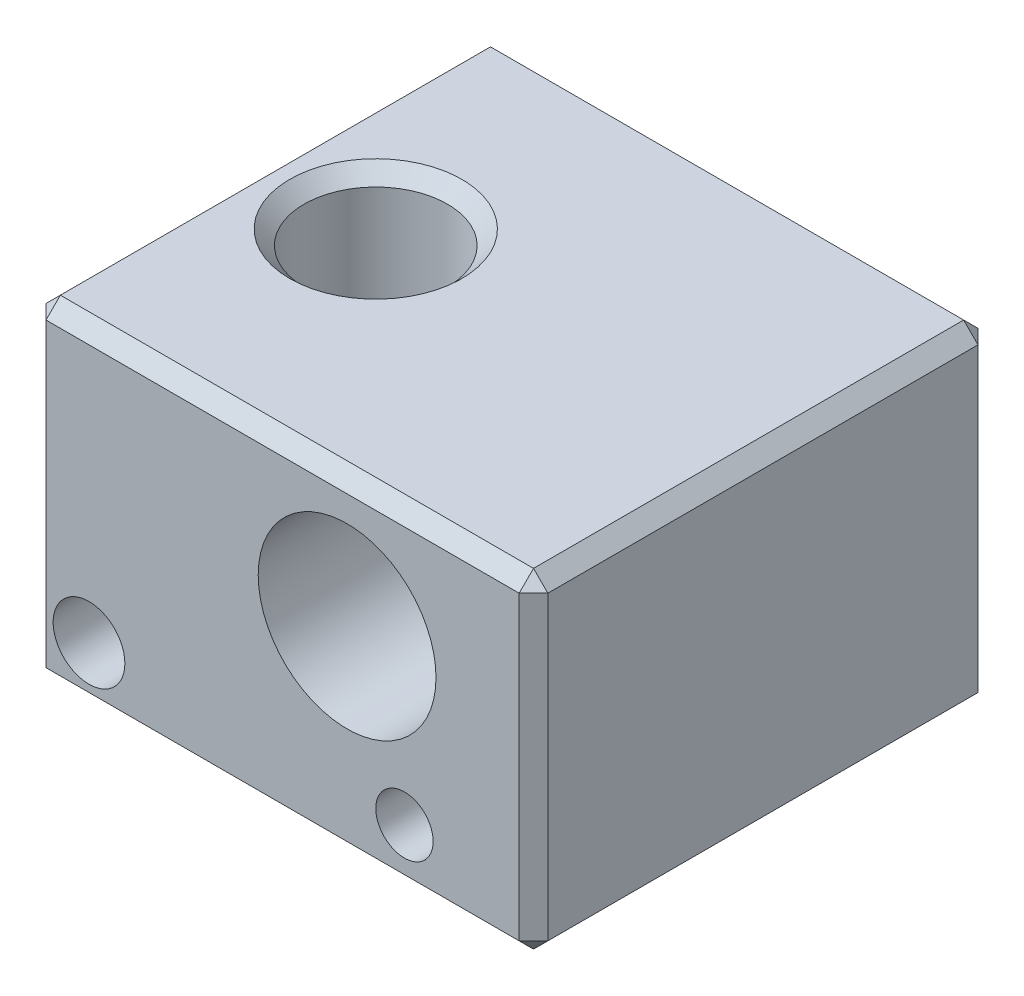
ISO-10303-21;
HEADER;
FILE_DESCRIPTION(('STEP AP214'),'2;1');
FILE_NAME('part.step','',(''),(''),'','','');
FILE_SCHEMA(('AUTOMOTIVE_DESIGN { 1 0 10303 214 1 1 1 1 }'));
ENDSEC;
DATA;
#1=APPLICATION_CONTEXT('core data for automotive mechanical design processes');
#2=APPLICATION_PROTOCOL_DEFINITION('international standard','automotive_design',2000,#1);
#3=PRODUCT_CONTEXT('',#1,'mechanical');
#4=PRODUCT('Part','Part','',(#3));
#5=PRODUCT_RELATED_PRODUCT_CATEGORY('part','',(#4));
#6=PRODUCT_DEFINITION_FORMATION('','',#4);
#7=PRODUCT_DEFINITION_CONTEXT('part definition',#1,'design');
#8=PRODUCT_DEFINITION('design','',#6,#7);
#9=PRODUCT_DEFINITION_SHAPE('','',#8);
#10=(LENGTH_UNIT() NAMED_UNIT(*) SI_UNIT(.MILLI.,.METRE.));
#11=(NAMED_UNIT(*) PLANE_ANGLE_UNIT() SI_UNIT($,.RADIAN.));
#12=(NAMED_UNIT(*) SI_UNIT($,.STERADIAN.) SOLID_ANGLE_UNIT());
#13=UNCERTAINTY_MEASURE_WITH_UNIT(LENGTH_MEASURE(1.E-05),#10,'distance_accuracy_value','');
#14=(GEOMETRIC_REPRESENTATION_CONTEXT(3) GLOBAL_UNCERTAINTY_ASSIGNED_CONTEXT((#13)) GLOBAL_UNIT_ASSIGNED_CONTEXT((#10,
#11,#12)) REPRESENTATION_CONTEXT('',''));
#15=CARTESIAN_POINT('',(0.,0.,0.));
#16=DIRECTION('',(0.,0.,1.));
#17=DIRECTION('',(1.,0.,0.));
#18=AXIS2_PLACEMENT_3D('',#15,#16,#17);
#19=CARTESIAN_POINT('',(-8.75,11.5,8.));
#20=DIRECTION('',(0.,0.,-1.));
#21=DIRECTION('',(-1.,0.,0.));
#22=AXIS2_PLACEMENT_3D('',#19,#20,#21);
#23=PLANE('',#22);
#24=DIRECTION('',(0.,-1.,0.));
#25=VECTOR('',#24,1.);
#26=CARTESIAN_POINT('',(-8.25,0.,8.));
#27=LINE('',#26,#25);
#28=CARTESIAN_POINT('',(-8.25,11.,8.));
#29=VERTEX_POINT('',#28);
#30=CARTESIAN_POINT('',(-8.25,0.500000000000004,8.));
#31=VERTEX_POINT('',#30);
#32=EDGE_CURVE('E354',#29,#31,#27,.T.);
#33=ORIENTED_EDGE('',*,*,#32,.T.);
#34=DIRECTION('',(1.,0.,0.));
#35=VECTOR('',#34,1.);
#36=CARTESIAN_POINT('',(-8.75,0.500000000000004,8.));
#37=LINE('',#36,#35);
#38=CARTESIAN_POINT('',(8.25,0.500000000000004,8.));
#39=VERTEX_POINT('',#38);
#40=EDGE_CURVE('E362',#31,#39,#37,.T.);
#41=ORIENTED_EDGE('',*,*,#40,.T.);
#42=DIRECTION('',(0.,1.,0.));
#43=VECTOR('',#42,1.);
#44=CARTESIAN_POINT('',(8.25,11.5,8.));
#45=LINE('',#44,#43);
#46=CARTESIAN_POINT('',(8.25,11.,8.));
#47=VERTEX_POINT('',#46);
#48=EDGE_CURVE('E344',#39,#47,#45,.T.);
#49=ORIENTED_EDGE('',*,*,#48,.T.);
#50=DIRECTION('',(-1.,0.,0.));
#51=VECTOR('',#50,1.);
#52=CARTESIAN_POINT('',(-8.75,11.,8.));
#53=LINE('',#52,#51);
#54=EDGE_CURVE('E350',#47,#29,#53,.T.);
#55=ORIENTED_EDGE('',*,*,#54,.T.);
#56=EDGE_LOOP('',(#33,#41,#49,#55));
#57=FACE_BOUND('',#56,.T.);
#58=CARTESIAN_POINT('',(-6.75,2.,8.));
#59=DIRECTION('',(0.,0.,1.));
#60=DIRECTION('',(1.,0.,0.));
#61=AXIS2_PLACEMENT_3D('',#58,#59,#60);
#62=CIRCLE('',#61,1.25);
#63=CARTESIAN_POINT('',(-5.5,2.,8.));
#64=VERTEX_POINT('',#63);
#65=EDGE_CURVE('E222',#64,#64,#62,.T.);
#66=ORIENTED_EDGE('',*,*,#65,.F.);
#67=EDGE_LOOP('',(#66));
#68=FACE_BOUND('',#67,.T.);
#69=CARTESIAN_POINT('',(4.25,2.,8.));
#70=DIRECTION('',(0.,0.,1.));
#71=DIRECTION('',(1.,0.,0.));
#72=AXIS2_PLACEMENT_3D('',#69,#70,#71);
#73=CIRCLE('',#72,1.);
#74=CARTESIAN_POINT('',(5.25,2.,8.));
#75=VERTEX_POINT('',#74);
#76=EDGE_CURVE('E419',#75,#75,#73,.T.);
#77=ORIENTED_EDGE('',*,*,#76,.F.);
#78=EDGE_LOOP('',(#77));
#79=FACE_BOUND('',#78,.T.);
#80=CARTESIAN_POINT('',(2.25,7.,8.));
#81=DIRECTION('',(0.,0.,1.));
#82=DIRECTION('',(1.,0.,0.));
#83=AXIS2_PLACEMENT_3D('',#80,#81,#82);
#84=CIRCLE('',#83,3.1);
#85=CARTESIAN_POINT('',(5.35,7.,8.));
#86=VERTEX_POINT('',#85);
#87=EDGE_CURVE('E413',#86,#86,#84,.T.);
#88=ORIENTED_EDGE('',*,*,#87,.F.);
#89=EDGE_LOOP('',(#88));
#90=FACE_BOUND('',#89,.T.);
#91=ADVANCED_FACE('F33',(#57,#68,#79,#90),#23,.F.);
#92=CARTESIAN_POINT('',(8.75,11.5,8.));
#93=DIRECTION('',(-1.,0.,0.));
#94=DIRECTION('',(0.,0.,1.));
#95=AXIS2_PLACEMENT_3D('',#92,#93,#94);
#96=PLANE('',#95);
#97=DIRECTION('',(0.,0.,1.));
#98=VECTOR('',#97,1.);
#99=CARTESIAN_POINT('',(8.75,11.,8.));
#100=LINE('',#99,#98);
#101=CARTESIAN_POINT('',(8.75,11.,-7.5));
#102=VERTEX_POINT('',#101);
#103=CARTESIAN_POINT('',(8.75,11.,7.5));
#104=VERTEX_POINT('',#103);
#105=EDGE_CURVE('E364',#102,#104,#100,.T.);
#106=ORIENTED_EDGE('',*,*,#105,.T.);
#107=DIRECTION('',(0.,-1.,0.));
#108=VECTOR('',#107,1.);
#109=CARTESIAN_POINT('',(8.75,11.5,7.5));
#110=LINE('',#109,#108);
#111=CARTESIAN_POINT('',(8.75,0.5,7.5));
#112=VERTEX_POINT('',#111);
#113=EDGE_CURVE('E346',#104,#112,#110,.T.);
#114=ORIENTED_EDGE('',*,*,#113,.T.);
#115=DIRECTION('',(0.,0.,-1.));
#116=VECTOR('',#115,1.);
#117=CARTESIAN_POINT('',(8.75,0.5,8.));
#118=LINE('',#117,#116);
#119=CARTESIAN_POINT('',(8.75,0.5,-7.5));
#120=VERTEX_POINT('',#119);
#121=EDGE_CURVE('E368',#112,#120,#118,.T.);
#122=ORIENTED_EDGE('',*,*,#121,.T.);
#123=DIRECTION('',(0.,1.,0.));
#124=VECTOR('',#123,1.);
#125=CARTESIAN_POINT('',(8.75,11.5,-7.5));
#126=LINE('',#125,#124);
#127=EDGE_CURVE('E366',#120,#102,#126,.T.);
#128=ORIENTED_EDGE('',*,*,#127,.T.);
#129=EDGE_LOOP('',(#106,#114,#122,#128));
#130=FACE_BOUND('',#129,.T.);
#131=ADVANCED_FACE('F254',(#130),#96,.F.);
#132=CARTESIAN_POINT('',(-8.75,11.5,-8.));
#133=DIRECTION('',(0.,0.,-1.));
#134=DIRECTION('',(-1.,0.,0.));
#135=AXIS2_PLACEMENT_3D('',#132,#133,#134);
#136=PLANE('',#135);
#137=DIRECTION('',(-1.,0.,0.));
#138=VECTOR('',#137,1.);
#139=CARTESIAN_POINT('',(-8.75,0.500000000000004,-8.));
#140=LINE('',#139,#138);
#141=CARTESIAN_POINT('',(8.25,0.500000000000004,-8.));
#142=VERTEX_POINT('',#141);
#143=CARTESIAN_POINT('',(-8.25,0.500000000000004,-8.));
#144=VERTEX_POINT('',#143);
#145=EDGE_CURVE('E357',#142,#144,#140,.T.);
#146=ORIENTED_EDGE('',*,*,#145,.T.);
#147=DIRECTION('',(0.,1.,0.));
#148=VECTOR('',#147,1.);
#149=CARTESIAN_POINT('',(-8.25,11.5,-8.));
#150=LINE('',#149,#148);
#151=CARTESIAN_POINT('',(-8.25,11.,-8.));
#152=VERTEX_POINT('',#151);
#153=EDGE_CURVE('E352',#144,#152,#150,.T.);
#154=ORIENTED_EDGE('',*,*,#153,.T.);
#155=DIRECTION('',(1.,0.,0.));
#156=VECTOR('',#155,1.);
#157=CARTESIAN_POINT('',(-8.75,11.,-8.));
#158=LINE('',#157,#156);
#159=CARTESIAN_POINT('',(8.25,11.,-8.));
#160=VERTEX_POINT('',#159);
#161=EDGE_CURVE('E383',#152,#160,#158,.T.);
#162=ORIENTED_EDGE('',*,*,#161,.T.);
#163=DIRECTION('',(0.,-1.,0.));
#164=VECTOR('',#163,1.);
#165=CARTESIAN_POINT('',(8.25,0.,-8.));
#166=LINE('',#165,#164);
#167=EDGE_CURVE('E385',#160,#142,#166,.T.);
#168=ORIENTED_EDGE('',*,*,#167,.T.);
#169=EDGE_LOOP('',(#146,#154,#162,#168));
#170=FACE_BOUND('',#169,.T.);
#171=CARTESIAN_POINT('',(4.25,2.,-8.));
#172=DIRECTION('',(0.,0.,1.));
#173=DIRECTION('',(1.,0.,0.));
#174=AXIS2_PLACEMENT_3D('',#171,#172,#173);
#175=CIRCLE('',#174,1.);
#176=CARTESIAN_POINT('',(5.25,2.,-8.));
#177=VERTEX_POINT('',#176);
#178=EDGE_CURVE('E416',#177,#177,#175,.T.);
#179=ORIENTED_EDGE('',*,*,#178,.T.);
#180=EDGE_LOOP('',(#179));
#181=FACE_BOUND('',#180,.T.);
#182=CARTESIAN_POINT('',(2.25,7.,-8.));
#183=DIRECTION('',(0.,0.,1.));
#184=DIRECTION('',(1.,0.,0.));
#185=AXIS2_PLACEMENT_3D('',#182,#183,#184);
#186=CIRCLE('',#185,3.1);
#187=CARTESIAN_POINT('',(5.35,7.,-8.));
#188=VERTEX_POINT('',#187);
#189=EDGE_CURVE('E143',#188,#188,#186,.T.);
#190=ORIENTED_EDGE('',*,*,#189,.T.);
#191=EDGE_LOOP('',(#190));
#192=FACE_BOUND('',#191,.T.);
#193=ADVANCED_FACE('F260',(#170,#181,#192),#136,.T.);
#194=CARTESIAN_POINT('',(-8.75,11.5,8.));
#195=DIRECTION('',(-1.,0.,0.));
#196=DIRECTION('',(0.,0.,1.));
#197=AXIS2_PLACEMENT_3D('',#194,#195,#196);
#198=PLANE('',#197);
#199=DIRECTION('',(0.,-1.,0.));
#200=VECTOR('',#199,1.);
#201=CARTESIAN_POINT('',(-8.75,11.5,-7.5));
#202=LINE('',#201,#200);
#203=CARTESIAN_POINT('',(-8.75,11.,-7.5));
#204=VERTEX_POINT('',#203);
#205=CARTESIAN_POINT('',(-8.75,0.500000000000004,-7.5));
#206=VERTEX_POINT('',#205);
#207=EDGE_CURVE('E378',#204,#206,#202,.T.);
#208=ORIENTED_EDGE('',*,*,#207,.T.);
#209=DIRECTION('',(0.,0.,1.));
#210=VECTOR('',#209,1.);
#211=CARTESIAN_POINT('',(-8.75,0.500000000000004,8.));
#212=LINE('',#211,#210);
#213=CARTESIAN_POINT('',(-8.75,0.500000000000004,7.5));
#214=VERTEX_POINT('',#213);
#215=EDGE_CURVE('E149',#206,#214,#212,.T.);
#216=ORIENTED_EDGE('',*,*,#215,.T.);
#217=DIRECTION('',(0.,1.,0.));
#218=VECTOR('',#217,1.);
#219=CARTESIAN_POINT('',(-8.75,11.5,7.5));
#220=LINE('',#219,#218);
#221=CARTESIAN_POINT('',(-8.75,11.,7.5));
#222=VERTEX_POINT('',#221);
#223=EDGE_CURVE('E392',#214,#222,#220,.T.);
#224=ORIENTED_EDGE('',*,*,#223,.T.);
#225=DIRECTION('',(0.,0.,-1.));
#226=VECTOR('',#225,1.);
#227=CARTESIAN_POINT('',(-8.75,11.,8.));
#228=LINE('',#227,#226);
#229=EDGE_CURVE('E394',#222,#204,#228,.T.);
#230=ORIENTED_EDGE('',*,*,#229,.T.);
#231=EDGE_LOOP('',(#208,#216,#224,#230));
#232=FACE_BOUND('',#231,.T.);
#233=ADVANCED_FACE('F454',(#232),#198,.T.);
#234=CARTESIAN_POINT('',(0.,11.5,0.));
#235=DIRECTION('',(0.,1.,0.));
#236=DIRECTION('',(0.,0.,1.));
#237=AXIS2_PLACEMENT_3D('',#234,#235,#236);
#238=PLANE('',#237);
#239=DIRECTION('',(-1.,0.,0.));
#240=VECTOR('',#239,1.);
#241=CARTESIAN_POINT('',(0.,11.5,-7.5));
#242=LINE('',#241,#240);
#243=CARTESIAN_POINT('',(8.25,11.5,-7.5));
#244=VERTEX_POINT('',#243);
#245=CARTESIAN_POINT('',(-8.25,11.5,-7.5));
#246=VERTEX_POINT('',#245);
#247=EDGE_CURVE('E42',#244,#246,#242,.T.);
#248=ORIENTED_EDGE('',*,*,#247,.T.);
#249=DIRECTION('',(0.,0.,1.));
#250=VECTOR('',#249,1.);
#251=CARTESIAN_POINT('',(-8.25,11.5,0.));
#252=LINE('',#251,#250);
#253=CARTESIAN_POINT('',(-8.25,11.5,7.5));
#254=VERTEX_POINT('',#253);
#255=EDGE_CURVE('E11',#246,#254,#252,.T.);
#256=ORIENTED_EDGE('',*,*,#255,.T.);
#257=DIRECTION('',(1.,0.,0.));
#258=VECTOR('',#257,1.);
#259=CARTESIAN_POINT('',(8.75,11.5,7.5));
#260=LINE('',#259,#258);
#261=CARTESIAN_POINT('',(8.25,11.5,7.5));
#262=VERTEX_POINT('',#261);
#263=EDGE_CURVE('E374',#254,#262,#260,.T.);
#264=ORIENTED_EDGE('',*,*,#263,.T.);
#265=DIRECTION('',(0.,0.,-1.));
#266=VECTOR('',#265,1.);
#267=CARTESIAN_POINT('',(8.25,11.5,-8.));
#268=LINE('',#267,#266);
#269=EDGE_CURVE('E53',#262,#244,#268,.T.);
#270=ORIENTED_EDGE('',*,*,#269,.T.);
#271=EDGE_LOOP('',(#248,#256,#264,#270));
#272=FACE_BOUND('',#271,.T.);
#273=CARTESIAN_POINT('',(-4.75,11.5,0.));
#274=DIRECTION('',(0.,1.,0.));
#275=DIRECTION('',(0.,0.,1.));
#276=AXIS2_PLACEMENT_3D('',#273,#274,#275);
#277=CIRCLE('',#276,2.99999999999999);
#278=CARTESIAN_POINT('',(-4.75,11.5,2.99999999999999));
#279=VERTEX_POINT('',#278);
#280=EDGE_CURVE('E371',#279,#279,#277,.F.);
#281=ORIENTED_EDGE('',*,*,#280,.T.);
#282=EDGE_LOOP('',(#281));
#283=FACE_BOUND('',#282,.T.);
#284=ADVANCED_FACE('F447',(#272,#283),#238,.T.);
#285=CARTESIAN_POINT('',(0.,0.,0.));
#286=DIRECTION('',(0.,1.,0.));
#287=DIRECTION('',(0.,0.,1.));
#288=AXIS2_PLACEMENT_3D('',#285,#286,#287);
#289=PLANE('',#288);
#290=CARTESIAN_POINT('',(-4.75,0.,0.));
#291=DIRECTION('',(0.,1.,0.));
#292=DIRECTION('',(0.,0.,1.));
#293=AXIS2_PLACEMENT_3D('',#290,#291,#292);
#294=CIRCLE('',#293,2.99999999999999);
#295=CARTESIAN_POINT('',(-4.75,0.,2.99999999999999));
#296=VERTEX_POINT('',#295);
#297=EDGE_CURVE('E404',#296,#296,#294,.T.);
#298=ORIENTED_EDGE('',*,*,#297,.T.);
#299=EDGE_LOOP('',(#298));
#300=FACE_BOUND('',#299,.T.);
#301=CARTESIAN_POINT('',(1.25,0.,0.));
#302=DIRECTION('',(0.,1.,0.));
#303=DIRECTION('',(0.,0.,1.));
#304=AXIS2_PLACEMENT_3D('',#301,#302,#303);
#305=CIRCLE('',#304,1.74999999999999);
#306=CARTESIAN_POINT('',(1.25,0.,1.74999999999999));
#307=VERTEX_POINT('',#306);
#308=EDGE_CURVE('E407',#307,#307,#305,.T.);
#309=ORIENTED_EDGE('',*,*,#308,.T.);
#310=EDGE_LOOP('',(#309));
#311=FACE_BOUND('',#310,.T.);
#312=DIRECTION('',(1.,0.,0.));
#313=VECTOR('',#312,1.);
#314=CARTESIAN_POINT('',(8.75,0.,-7.5));
#315=LINE('',#314,#313);
#316=CARTESIAN_POINT('',(-8.25,0.,-7.5));
#317=VERTEX_POINT('',#316);
#318=CARTESIAN_POINT('',(8.25,0.,-7.5));
#319=VERTEX_POINT('',#318);
#320=EDGE_CURVE('E125',#317,#319,#315,.T.);
#321=ORIENTED_EDGE('',*,*,#320,.T.);
#322=DIRECTION('',(0.,0.,1.));
#323=VECTOR('',#322,1.);
#324=CARTESIAN_POINT('',(8.25,0.,0.));
#325=LINE('',#324,#323);
#326=CARTESIAN_POINT('',(8.25,0.,7.5));
#327=VERTEX_POINT('',#326);
#328=EDGE_CURVE('E410',#319,#327,#325,.T.);
#329=ORIENTED_EDGE('',*,*,#328,.T.);
#330=DIRECTION('',(-1.,0.,0.));
#331=VECTOR('',#330,1.);
#332=CARTESIAN_POINT('',(0.,0.,7.5));
#333=LINE('',#332,#331);
#334=CARTESIAN_POINT('',(-8.25,0.,7.5));
#335=VERTEX_POINT('',#334);
#336=EDGE_CURVE('E127',#327,#335,#333,.T.);
#337=ORIENTED_EDGE('',*,*,#336,.T.);
#338=DIRECTION('',(0.,0.,-1.));
#339=VECTOR('',#338,1.);
#340=CARTESIAN_POINT('',(-8.25,0.,-8.));
#341=LINE('',#340,#339);
#342=EDGE_CURVE('E121',#335,#317,#341,.T.);
#343=ORIENTED_EDGE('',*,*,#342,.T.);
#344=EDGE_LOOP('',(#321,#329,#337,#343));
#345=FACE_BOUND('',#344,.T.);
#346=ADVANCED_FACE('F123',(#300,#311,#345),#289,.F.);
#347=CARTESIAN_POINT('',(2.25,7.,-8.));
#348=DIRECTION('',(0.,0.,1.));
#349=DIRECTION('',(1.,0.,0.));
#350=AXIS2_PLACEMENT_3D('',#347,#348,#349);
#351=CYLINDRICAL_SURFACE('',#350,3.1);
#352=CARTESIAN_POINT('',(1.25,4.06571984977576,-1.25));
#353=CARTESIAN_POINT('',(1.31412407102761,4.04386931657047,-1.24999682356544));
#354=CARTESIAN_POINT('',(1.3790323605544,4.02411324985325,-1.24504633684303));
#355=CARTESIAN_POINT('',(1.50852514450525,3.98923249124023,-1.22473081712279));
#356=CARTESIAN_POINT('',(1.57310928391037,3.97411209996811,-1.20935615557821));
#357=CARTESIAN_POINT('',(1.69989951240687,3.94851243111399,-1.16813357100094));
#358=CARTESIAN_POINT('',(1.7621031224863,3.93803787752112,-1.14227503862974));
#359=CARTESIAN_POINT('',(1.88195571275443,3.92132984840443,-1.08059009030169));
#360=CARTESIAN_POINT('',(1.93960522979695,3.9150958723238,-1.04476485151625));
#361=CARTESIAN_POINT('',(2.04749646548957,3.9061553785297,-0.964844569883464));
#362=CARTESIAN_POINT('',(2.09785468706466,3.90338624247298,-0.920913307988027));
#363=CARTESIAN_POINT('',(2.19096515404916,3.9002113379841,-0.825546991201818));
#364=CARTESIAN_POINT('',(2.23371611790488,3.89980596739803,-0.77411067462625));
#365=CARTESIAN_POINT('',(2.31159260293196,3.90035946609992,-0.663497060760645));
#366=CARTESIAN_POINT('',(2.34645925371717,3.90135848340574,-0.604137697597038));
#367=CARTESIAN_POINT('',(2.40599100394901,3.90378325578923,-0.48051332323618));
#368=CARTESIAN_POINT('',(2.43065507855612,3.90520905371185,-0.416247819989271));
#369=CARTESIAN_POINT('',(2.46956346048699,3.90772172802315,-0.283004227305717));
#370=CARTESIAN_POINT('',(2.48355335949015,3.90879999521813,-0.213951486933705));
#371=CARTESIAN_POINT('',(2.49975342466547,3.91006624436077,-0.0744708002820158));
#372=CARTESIAN_POINT('',(2.50196372633312,3.91025423654886,-0.00404286982989444));
#373=CARTESIAN_POINT('',(2.49454584579713,3.90965852729883,0.13610331981758));
#374=CARTESIAN_POINT('',(2.48493084752302,3.90887590797932,0.205822282120604));
#375=CARTESIAN_POINT('',(2.45416096316388,3.90669215451381,0.342658473349358));
#376=CARTESIAN_POINT('',(2.43300525336871,3.90529097621996,0.409775516198638));
#377=CARTESIAN_POINT('',(2.37971705925274,3.90260076032698,0.539600864597366));
#378=CARTESIAN_POINT('',(2.34757104261828,3.90131186344619,0.602303619527018));
#379=CARTESIAN_POINT('',(2.27320544748314,3.89986461575388,0.721443742705734));
#380=CARTESIAN_POINT('',(2.23098576274907,3.89970627686539,0.777881044872322));
#381=CARTESIAN_POINT('',(2.13783342606414,3.90168164861602,0.882695629692788));
#382=CARTESIAN_POINT('',(2.08692789470841,3.90380833082803,0.931097102225148));
#383=CARTESIAN_POINT('',(1.97789903274865,3.91148275042813,1.01859946114047));
#384=CARTESIAN_POINT('',(1.9197779427384,3.91702942794207,1.0577032237314));
#385=CARTESIAN_POINT('',(1.80012644860688,3.93224260272356,1.12446031488305));
#386=CARTESIAN_POINT('',(1.73875355593523,3.94177863189459,1.15242580114432));
#387=CARTESIAN_POINT('',(1.61312125667163,3.96545446304068,1.19795912574914));
#388=CARTESIAN_POINT('',(1.54886232190712,3.97959351483077,1.21552865707629));
#389=CARTESIAN_POINT('',(1.42069358533456,4.01226682493206,1.23997912488614));
#390=CARTESIAN_POINT('',(1.35679724119452,4.03072012533362,1.24704113706527));
#391=CARTESIAN_POINT('',(1.23004597127626,4.07183711455998,1.25145005951004));
#392=CARTESIAN_POINT('',(1.16719133547123,4.09450195497261,1.24879430886528));
#393=CARTESIAN_POINT('',(1.04039996352612,4.14486637335437,1.23404889696496));
#394=CARTESIAN_POINT('',(0.976613400157806,4.17278229677925,1.22141881599695));
#395=CARTESIAN_POINT('',(0.853094627899885,4.23172480365729,1.18704722608764));
#396=CARTESIAN_POINT('',(0.793363440636949,4.26275216610093,1.16530343105146));
#397=CARTESIAN_POINT('',(0.671170633610504,4.33113821293562,1.11019217671031));
#398=CARTESIAN_POINT('',(0.609396782320378,4.36879094402457,1.07566592104613));
#399=CARTESIAN_POINT('',(0.492828996935742,4.4451575339971,0.997068324896723));
#400=CARTESIAN_POINT('',(0.43804788503108,4.48387318839118,0.952979839015347));
#401=CARTESIAN_POINT('',(0.329811317985731,4.5652493581044,0.84973208913941));
#402=CARTESIAN_POINT('',(0.277402628875412,4.60778841664885,0.78937125648153));
#403=CARTESIAN_POINT('',(0.183940511899612,4.68803781259185,0.657652699139252));
#404=CARTESIAN_POINT('',(0.142858403867072,4.72576021366949,0.58632347533955));
#405=CARTESIAN_POINT('',(0.0875849245627656,4.77855333774515,0.462557639917995));
#406=CARTESIAN_POINT('',(0.0691231335481326,4.79676287087563,0.413367344271982));
#407=CARTESIAN_POINT('',(0.038269805287948,4.82773679133903,0.311499179493663));
#408=CARTESIAN_POINT('',(0.025868544242418,4.84050989685295,0.258827051979021));
#409=CARTESIAN_POINT('',(0.00788154630941557,4.85918640303962,0.150576807086339));
#410=CARTESIAN_POINT('',(0.00235946165357998,4.86502562241385,0.0949764403431556));
#411=CARTESIAN_POINT('',(-0.00113452717185398,4.86870869109976,-0.0167257193774434));
#412=CARTESIAN_POINT('',(0.000890693999757951,4.86655558457313,-0.0728273133239358));
#413=CARTESIAN_POINT('',(0.0115785165923485,4.85535245667867,-0.176640207564638));
#414=CARTESIAN_POINT('',(0.0194019510346283,4.84717513891782,-0.224540654398174));
#415=CARTESIAN_POINT('',(0.0401898304081884,4.82584267352125,-0.31805286893275));
#416=CARTESIAN_POINT('',(0.0531580161525052,4.81268390412906,-0.363662944029741));
#417=CARTESIAN_POINT('',(0.0901626492437566,4.77603236941032,-0.470880626168047));
#418=CARTESIAN_POINT('',(0.116560750198719,4.75052707780665,-0.530981431141113));
#419=CARTESIAN_POINT('',(0.177112096806264,4.69460608468315,-0.644654810619276));
#420=CARTESIAN_POINT('',(0.211283588160857,4.66417887978582,-0.698211562882469));
#421=CARTESIAN_POINT('',(0.296632682710524,4.59204167799534,-0.812383187083013));
#422=CARTESIAN_POINT('',(0.349905355645053,4.54952185264107,-0.870922323350581));
#423=CARTESIAN_POINT('',(0.46609478271498,4.46368107503741,-0.976818044097292));
#424=CARTESIAN_POINT('',(0.529019916338808,4.42035945574847,-1.02416482064182));
#425=CARTESIAN_POINT('',(0.663927766153438,4.33527163579194,-1.10694157287936));
#426=CARTESIAN_POINT('',(0.735962825568991,4.29351639302137,-1.14229794759976));
#427=CARTESIAN_POINT('',(0.887343462115775,4.21424966883542,-1.19894283194074));
#428=CARTESIAN_POINT('',(0.966662615134415,4.17672386857871,-1.22028006615794));
#429=CARTESIAN_POINT('',(1.08136793930619,4.12848715119251,-1.23902278442863));
#430=CARTESIAN_POINT('',(1.11466000756247,4.11516072866024,-1.2431091379948));
#431=CARTESIAN_POINT('',(1.18189370742814,4.08959773467645,-1.24859903306798));
#432=CARTESIAN_POINT('',(1.21583554893592,4.07736152287064,-1.25000169236203));
#433=CARTESIAN_POINT('',(1.25,4.06571984977576,-1.25));
#434=B_SPLINE_CURVE_WITH_KNOTS('',3,(#352,#353,#354,#355,#356,#357,#358,#359,#360,#361,#362,
#363,#364,#365,#366,#367,#368,#369,#370,#371,#372,#373,#374,#375,#376,#377,#378,#379,#380,#381,
#382,#383,#384,#385,#386,#387,#388,#389,#390,#391,#392,#393,#394,#395,#396,#397,#398,#399,#400,
#401,#402,#403,#404,#405,#406,#407,#408,#409,#410,#411,#412,#413,#414,#415,#416,#417,#418,#419,
#420,#421,#422,#423,#424,#425,#426,#427,#428,#429,#430,#431,#432,#433),.UNSPECIFIED.,.T.,.F.,(4,
2,2,2,2,2,2,2,2,2,2,2,2,2,2,2,2,2,2,2,2,2,2,2,2,2,2,2,2,2,2,2,2,2,2,2,2,2,2,2,4),(0.,
0.203106901637013,0.406401664025731,0.609902669700279,0.813379649991945,1.01312353075625,
1.21290102950349,1.41850722043965,1.62413405931888,1.83452067354489,2.04490486778157,
2.25505471888995,2.46521957125866,2.67564413620871,2.88607092032087,3.09585230705911,
3.30556871411916,3.50890505804192,3.71220827947522,3.91196568210335,4.11177778624364,
4.32322687709546,4.53472903986192,4.77426968848165,5.01424344552383,5.28461256836008,
5.55429066399378,5.72053905381196,5.88651982393155,6.05402525513779,6.22146689248854,
6.36849795003851,6.51563611222959,6.72574116876292,6.93634456763189,7.20454767246493,
7.47298494124712,7.74304134015153,8.01215410127126,8.120331198527,8.2285438508205),.UNSPECIFIED.);
#435=CARTESIAN_POINT('',(1.25,4.06571984977576,-1.25));
#436=VERTEX_POINT('',#435);
#437=EDGE_CURVE('E216',#436,#436,#434,.T.);
#438=ORIENTED_EDGE('',*,*,#437,.T.);
#439=EDGE_LOOP('',(#438));
#440=FACE_BOUND('',#439,.T.);
#441=ORIENTED_EDGE('',*,*,#189,.F.);
#442=EDGE_LOOP('',(#441));
#443=FACE_BOUND('',#442,.T.);
#444=ORIENTED_EDGE('',*,*,#87,.T.);
#445=EDGE_LOOP('',(#444));
#446=FACE_BOUND('',#445,.T.);
#447=ADVANCED_FACE('F437',(#440,#443,#446),#351,.F.);
#448=CARTESIAN_POINT('',(4.25,2.,-8.));
#449=DIRECTION('',(0.,0.,1.));
#450=DIRECTION('',(1.,0.,0.));
#451=AXIS2_PLACEMENT_3D('',#448,#449,#450);
#452=CYLINDRICAL_SURFACE('',#451,1.);
#453=ORIENTED_EDGE('',*,*,#178,.F.);
#454=EDGE_LOOP('',(#453));
#455=FACE_BOUND('',#454,.T.);
#456=ORIENTED_EDGE('',*,*,#76,.T.);
#457=EDGE_LOOP('',(#456));
#458=FACE_BOUND('',#457,.T.);
#459=ADVANCED_FACE('F439',(#455,#458),#452,.F.);
#460=CARTESIAN_POINT('',(-6.75,2.,3.5));
#461=DIRECTION('',(0.,0.,-1.));
#462=DIRECTION('',(-1.,0.,0.));
#463=AXIS2_PLACEMENT_3D('',#460,#461,#462);
#464=PLANE('',#463);
#465=CARTESIAN_POINT('',(-6.75,2.,3.5));
#466=DIRECTION('',(0.,0.,1.));
#467=DIRECTION('',(1.,0.,0.));
#468=AXIS2_PLACEMENT_3D('',#465,#466,#467);
#469=CIRCLE('',#468,1.25);
#470=CARTESIAN_POINT('',(-5.5,2.,3.5));
#471=VERTEX_POINT('',#470);
#472=EDGE_CURVE('E227',#471,#471,#469,.T.);
#473=ORIENTED_EDGE('',*,*,#472,.T.);
#474=EDGE_LOOP('',(#473));
#475=FACE_BOUND('',#474,.T.);
#476=ADVANCED_FACE('F426',(#475),#464,.F.);
#477=CARTESIAN_POINT('',(-6.75,2.,8.));
#478=DIRECTION('',(0.,0.,1.));
#479=DIRECTION('',(1.,0.,0.));
#480=AXIS2_PLACEMENT_3D('',#477,#478,#479);
#481=CYLINDRICAL_SURFACE('',#480,1.25);
#482=ORIENTED_EDGE('',*,*,#472,.F.);
#483=EDGE_LOOP('',(#482));
#484=FACE_BOUND('',#483,.T.);
#485=ORIENTED_EDGE('',*,*,#65,.T.);
#486=EDGE_LOOP('',(#485));
#487=FACE_BOUND('',#486,.T.);
#488=ADVANCED_FACE('F249',(#484,#487),#481,.F.);
#489=CARTESIAN_POINT('',(-4.75,11.5,0.));
#490=DIRECTION('',(0.,1.,0.));
#491=DIRECTION('',(0.,0.,1.));
#492=AXIS2_PLACEMENT_3D('',#489,#490,#491);
#493=CYLINDRICAL_SURFACE('',#492,2.49999999999999);
#494=CARTESIAN_POINT('',(-4.75,0.5,0.));
#495=DIRECTION('',(0.,1.,0.));
#496=DIRECTION('',(0.,0.,1.));
#497=AXIS2_PLACEMENT_3D('',#494,#495,#496);
#498=CIRCLE('',#497,2.49999999999999);
#499=CARTESIAN_POINT('',(-4.75,0.5,2.49999999999999));
#500=VERTEX_POINT('',#499);
#501=EDGE_CURVE('E398',#500,#500,#498,.F.);
#502=ORIENTED_EDGE('',*,*,#501,.T.);
#503=EDGE_LOOP('',(#502));
#504=FACE_BOUND('',#503,.T.);
#505=CARTESIAN_POINT('',(-4.75,11.,0.));
#506=DIRECTION('',(0.,1.,0.));
#507=DIRECTION('',(0.,0.,1.));
#508=AXIS2_PLACEMENT_3D('',#505,#506,#507);
#509=CIRCLE('',#508,2.49999999999999);
#510=CARTESIAN_POINT('',(-4.75,11.,2.49999999999999));
#511=VERTEX_POINT('',#510);
#512=EDGE_CURVE('E401',#511,#511,#509,.T.);
#513=ORIENTED_EDGE('',*,*,#512,.T.);
#514=EDGE_LOOP('',(#513));
#515=FACE_BOUND('',#514,.T.);
#516=ADVANCED_FACE('F240',(#504,#515),#493,.F.);
#517=CARTESIAN_POINT('',(1.25,0.,0.));
#518=DIRECTION('',(0.,-1.,0.));
#519=DIRECTION('',(0.,0.,-1.));
#520=AXIS2_PLACEMENT_3D('',#517,#518,#519);
#521=CYLINDRICAL_SURFACE('',#520,1.25);
#522=CARTESIAN_POINT('',(1.25,0.499999999999996,0.));
#523=DIRECTION('',(0.,1.,0.));
#524=DIRECTION('',(0.,0.,1.));
#525=AXIS2_PLACEMENT_3D('',#522,#523,#524);
#526=CIRCLE('',#525,1.25);
#527=CARTESIAN_POINT('',(1.25,0.499999999999996,1.25));
#528=VERTEX_POINT('',#527);
#529=EDGE_CURVE('E396',#528,#528,#526,.F.);
#530=ORIENTED_EDGE('',*,*,#529,.T.);
#531=EDGE_LOOP('',(#530));
#532=FACE_BOUND('',#531,.T.);
#533=ORIENTED_EDGE('',*,*,#437,.F.);
#534=EDGE_LOOP('',(#533));
#535=FACE_BOUND('',#534,.T.);
#536=ADVANCED_FACE('F236',(#532,#535),#521,.F.);
#537=CARTESIAN_POINT('',(-4.75,0.,0.));
#538=DIRECTION('',(0.,-1.,0.));
#539=DIRECTION('',(0.,0.,-1.));
#540=AXIS2_PLACEMENT_3D('',#537,#538,#539);
#541=CONICAL_SURFACE('',#540,2.99999999999999,0.785398163397447);
#542=ORIENTED_EDGE('',*,*,#501,.F.);
#543=EDGE_LOOP('',(#542));
#544=FACE_BOUND('',#543,.T.);
#545=ORIENTED_EDGE('',*,*,#297,.F.);
#546=EDGE_LOOP('',(#545));
#547=FACE_BOUND('',#546,.T.);
#548=ADVANCED_FACE('F239',(#544,#547),#541,.F.);
#549=CARTESIAN_POINT('',(1.25,0.499999999999996,0.));
#550=DIRECTION('',(0.,-1.,0.));
#551=DIRECTION('',(0.,0.,-1.));
#552=AXIS2_PLACEMENT_3D('',#549,#550,#551);
#553=CONICAL_SURFACE('',#552,1.25,0.785398163397447);
#554=ORIENTED_EDGE('',*,*,#308,.F.);
#555=EDGE_LOOP('',(#554));
#556=FACE_BOUND('',#555,.T.);
#557=ORIENTED_EDGE('',*,*,#529,.F.);
#558=EDGE_LOOP('',(#557));
#559=FACE_BOUND('',#558,.T.);
#560=ADVANCED_FACE('F246',(#556,#559),#553,.F.);
#561=CARTESIAN_POINT('',(8.75,11.5,7.5));
#562=DIRECTION('',(-0.707106781186545,0.,-0.70710678118655));
#563=DIRECTION('',(0.,-1.,0.));
#564=AXIS2_PLACEMENT_3D('',#561,#562,#563);
#565=PLANE('',#564);
#566=DIRECTION('',(-0.70710678118655,0.,0.707106781186545));
#567=VECTOR('',#566,1.);
#568=CARTESIAN_POINT('',(8.25,11.,8.));
#569=LINE('',#568,#567);
#570=EDGE_CURVE('E37',#47,#104,#569,.F.);
#571=ORIENTED_EDGE('',*,*,#570,.F.);
#572=ORIENTED_EDGE('',*,*,#48,.F.);
#573=DIRECTION('',(0.70710678118655,0.,-0.707106781186545));
#574=VECTOR('',#573,1.);
#575=CARTESIAN_POINT('',(8.75,0.5,7.5));
#576=LINE('',#575,#574);
#577=EDGE_CURVE('E209',#112,#39,#576,.F.);
#578=ORIENTED_EDGE('',*,*,#577,.F.);
#579=ORIENTED_EDGE('',*,*,#113,.F.);
#580=EDGE_LOOP('',(#571,#572,#578,#579));
#581=FACE_BOUND('',#580,.T.);
#582=ADVANCED_FACE('F269',(#581),#565,.F.);
#583=CARTESIAN_POINT('',(8.25,11.,8.));
#584=DIRECTION('',(0.577350269189626,0.577350269189622,0.57735026918963));
#585=DIRECTION('',(0.70710678118655,0.,-0.707106781186545));
#586=AXIS2_PLACEMENT_3D('',#583,#584,#585);
#587=PLANE('',#586);
#588=DIRECTION('',(0.,-0.70710678118655,0.707106781186545));
#589=VECTOR('',#588,1.);
#590=CARTESIAN_POINT('',(8.25,11.,8.));
#591=LINE('',#590,#589);
#592=EDGE_CURVE('E204',#47,#262,#591,.F.);
#593=ORIENTED_EDGE('',*,*,#592,.F.);
#594=ORIENTED_EDGE('',*,*,#570,.T.);
#595=DIRECTION('',(-0.707106781186545,0.70710678118655,0.));
#596=VECTOR('',#595,1.);
#597=CARTESIAN_POINT('',(8.5,11.25,7.5));
#598=LINE('',#597,#596);
#599=EDGE_CURVE('E207',#262,#104,#598,.F.);
#600=ORIENTED_EDGE('',*,*,#599,.F.);
#601=EDGE_LOOP('',(#593,#594,#600));
#602=FACE_BOUND('',#601,.T.);
#603=ADVANCED_FACE('F336',(#602),#587,.T.);
#604=CARTESIAN_POINT('',(8.75,0.5,7.5));
#605=DIRECTION('',(0.577350269189622,-0.577350269189626,0.57735026918963));
#606=DIRECTION('',(0.,-0.70710678118655,-0.707106781186545));
#607=AXIS2_PLACEMENT_3D('',#604,#605,#606);
#608=PLANE('',#607);
#609=DIRECTION('',(-0.70710678118655,-0.707106781186545,0.));
#610=VECTOR('',#609,1.);
#611=CARTESIAN_POINT('',(8.75,0.5,7.5));
#612=LINE('',#611,#610);
#613=EDGE_CURVE('E198',#112,#327,#612,.T.);
#614=ORIENTED_EDGE('',*,*,#613,.F.);
#615=ORIENTED_EDGE('',*,*,#577,.T.);
#616=DIRECTION('',(0.,0.70710678118655,0.707106781186545));
#617=VECTOR('',#616,1.);
#618=CARTESIAN_POINT('',(8.25,0.250000000000002,7.75));
#619=LINE('',#618,#617);
#620=EDGE_CURVE('E201',#327,#39,#619,.T.);
#621=ORIENTED_EDGE('',*,*,#620,.F.);
#622=EDGE_LOOP('',(#614,#615,#621));
#623=FACE_BOUND('',#622,.T.);
#624=ADVANCED_FACE('F332',(#623),#608,.T.);
#625=CARTESIAN_POINT('',(8.25,11.5,0.));
#626=DIRECTION('',(0.70710678118655,0.707106781186545,0.));
#627=DIRECTION('',(0.,0.,1.));
#628=AXIS2_PLACEMENT_3D('',#625,#626,#627);
#629=PLANE('',#628);
#630=ORIENTED_EDGE('',*,*,#599,.T.);
#631=ORIENTED_EDGE('',*,*,#105,.F.);
#632=DIRECTION('',(0.707106781186545,-0.70710678118655,0.));
#633=VECTOR('',#632,1.);
#634=CARTESIAN_POINT('',(8.75,11.,-7.5));
#635=LINE('',#634,#633);
#636=EDGE_CURVE('E192',#244,#102,#635,.T.);
#637=ORIENTED_EDGE('',*,*,#636,.F.);
#638=ORIENTED_EDGE('',*,*,#269,.F.);
#639=EDGE_LOOP('',(#630,#631,#637,#638));
#640=FACE_BOUND('',#639,.T.);
#641=ADVANCED_FACE('F328',(#640),#629,.T.);
#642=CARTESIAN_POINT('',(0.,11.5,7.5));
#643=DIRECTION('',(0.,0.707106781186545,0.70710678118655));
#644=DIRECTION('',(-1.,0.,0.));
#645=AXIS2_PLACEMENT_3D('',#642,#643,#644);
#646=PLANE('',#645);
#647=ORIENTED_EDGE('',*,*,#592,.T.);
#648=ORIENTED_EDGE('',*,*,#263,.F.);
#649=DIRECTION('',(0.,0.70710678118655,-0.707106781186545));
#650=VECTOR('',#649,1.);
#651=CARTESIAN_POINT('',(-8.25,11.25,7.75));
#652=LINE('',#651,#650);
#653=EDGE_CURVE('E189',#29,#254,#652,.T.);
#654=ORIENTED_EDGE('',*,*,#653,.F.);
#655=ORIENTED_EDGE('',*,*,#54,.F.);
#656=EDGE_LOOP('',(#647,#648,#654,#655));
#657=FACE_BOUND('',#656,.T.);
#658=ADVANCED_FACE('F324',(#657),#646,.T.);
#659=CARTESIAN_POINT('',(-8.25,11.5,8.));
#660=DIRECTION('',(-0.707106781186545,0.,0.70710678118655));
#661=DIRECTION('',(0.,1.,0.));
#662=AXIS2_PLACEMENT_3D('',#659,#660,#661);
#663=PLANE('',#662);
#664=DIRECTION('',(-0.70710678118655,0.,-0.707106781186545));
#665=VECTOR('',#664,1.);
#666=CARTESIAN_POINT('',(-8.25,0.500000000000004,8.));
#667=LINE('',#666,#665);
#668=EDGE_CURVE('E183',#31,#214,#667,.T.);
#669=ORIENTED_EDGE('',*,*,#668,.F.);
#670=ORIENTED_EDGE('',*,*,#32,.F.);
#671=DIRECTION('',(0.70710678118655,0.,0.707106781186545));
#672=VECTOR('',#671,1.);
#673=CARTESIAN_POINT('',(-8.75,11.,7.5));
#674=LINE('',#673,#672);
#675=EDGE_CURVE('E186',#222,#29,#674,.T.);
#676=ORIENTED_EDGE('',*,*,#675,.F.);
#677=ORIENTED_EDGE('',*,*,#223,.F.);
#678=EDGE_LOOP('',(#669,#670,#676,#677));
#679=FACE_BOUND('',#678,.T.);
#680=ADVANCED_FACE('F320',(#679),#663,.T.);
#681=CARTESIAN_POINT('',(-8.75,0.500000000000004,8.));
#682=DIRECTION('',(0.,0.707106781186545,-0.70710678118655));
#683=DIRECTION('',(1.,0.,0.));
#684=AXIS2_PLACEMENT_3D('',#681,#682,#683);
#685=PLANE('',#684);
#686=ORIENTED_EDGE('',*,*,#620,.T.);
#687=ORIENTED_EDGE('',*,*,#40,.F.);
#688=DIRECTION('',(0.,-0.70710678118655,-0.707106781186545));
#689=VECTOR('',#688,1.);
#690=CARTESIAN_POINT('',(-8.25,0.500000000000004,8.));
#691=LINE('',#690,#689);
#692=EDGE_CURVE('E181',#335,#31,#691,.F.);
#693=ORIENTED_EDGE('',*,*,#692,.F.);
#694=ORIENTED_EDGE('',*,*,#336,.F.);
#695=EDGE_LOOP('',(#686,#687,#693,#694));
#696=FACE_BOUND('',#695,.T.);
#697=ADVANCED_FACE('F316',(#696),#685,.F.);
#698=CARTESIAN_POINT('',(8.75,0.5,8.));
#699=DIRECTION('',(-0.707106781186545,0.70710678118655,0.));
#700=DIRECTION('',(0.,0.,-1.));
#701=AXIS2_PLACEMENT_3D('',#698,#699,#700);
#702=PLANE('',#701);
#703=ORIENTED_EDGE('',*,*,#613,.T.);
#704=ORIENTED_EDGE('',*,*,#328,.F.);
#705=DIRECTION('',(0.70710678118655,0.707106781186545,0.));
#706=VECTOR('',#705,1.);
#707=CARTESIAN_POINT('',(8.75,0.5,-7.5));
#708=LINE('',#707,#706);
#709=EDGE_CURVE('E178',#120,#319,#708,.F.);
#710=ORIENTED_EDGE('',*,*,#709,.F.);
#711=ORIENTED_EDGE('',*,*,#121,.F.);
#712=EDGE_LOOP('',(#703,#704,#710,#711));
#713=FACE_BOUND('',#712,.T.);
#714=ADVANCED_FACE('F312',(#713),#702,.F.);
#715=CARTESIAN_POINT('',(8.25,11.5,-8.));
#716=DIRECTION('',(0.70710678118655,0.,-0.707106781186545));
#717=DIRECTION('',(0.,1.,0.));
#718=AXIS2_PLACEMENT_3D('',#715,#716,#717);
#719=PLANE('',#718);
#720=DIRECTION('',(-0.707106781186545,0.,-0.70710678118655));
#721=VECTOR('',#720,1.);
#722=CARTESIAN_POINT('',(8.75,11.,-7.5));
#723=LINE('',#722,#721);
#724=EDGE_CURVE('E195',#102,#160,#723,.T.);
#725=ORIENTED_EDGE('',*,*,#724,.F.);
#726=ORIENTED_EDGE('',*,*,#127,.F.);
#727=DIRECTION('',(0.707106781186545,0.,0.70710678118655));
#728=VECTOR('',#727,1.);
#729=CARTESIAN_POINT('',(8.75,0.5,-7.5));
#730=LINE('',#729,#728);
#731=EDGE_CURVE('E175',#142,#120,#730,.T.);
#732=ORIENTED_EDGE('',*,*,#731,.F.);
#733=ORIENTED_EDGE('',*,*,#167,.F.);
#734=EDGE_LOOP('',(#725,#726,#732,#733));
#735=FACE_BOUND('',#734,.T.);
#736=ADVANCED_FACE('F308',(#735),#719,.T.);
#737=CARTESIAN_POINT('',(8.75,11.,-7.5));
#738=DIRECTION('',(0.57735026918963,0.577350269189622,-0.577350269189626));
#739=DIRECTION('',(-0.707106781186545,0.,-0.70710678118655));
#740=AXIS2_PLACEMENT_3D('',#737,#738,#739);
#741=PLANE('',#740);
#742=ORIENTED_EDGE('',*,*,#636,.T.);
#743=ORIENTED_EDGE('',*,*,#724,.T.);
#744=DIRECTION('',(0.,-0.70710678118655,-0.707106781186545));
#745=VECTOR('',#744,1.);
#746=CARTESIAN_POINT('',(8.25,11.25,-7.75));
#747=LINE('',#746,#745);
#748=EDGE_CURVE('E172',#244,#160,#747,.T.);
#749=ORIENTED_EDGE('',*,*,#748,.F.);
#750=EDGE_LOOP('',(#742,#743,#749));
#751=FACE_BOUND('',#750,.T.);
#752=ADVANCED_FACE('F304',(#751),#741,.T.);
#753=CARTESIAN_POINT('',(-8.75,11.,7.5));
#754=DIRECTION('',(-0.577350269189626,0.577350269189622,0.57735026918963));
#755=DIRECTION('',(0.70710678118655,0.,0.707106781186545));
#756=AXIS2_PLACEMENT_3D('',#753,#754,#755);
#757=PLANE('',#756);
#758=ORIENTED_EDGE('',*,*,#675,.T.);
#759=ORIENTED_EDGE('',*,*,#653,.T.);
#760=DIRECTION('',(0.707106781186545,0.70710678118655,0.));
#761=VECTOR('',#760,1.);
#762=CARTESIAN_POINT('',(-8.75,11.,7.5));
#763=LINE('',#762,#761);
#764=EDGE_CURVE('E170',#222,#254,#763,.T.);
#765=ORIENTED_EDGE('',*,*,#764,.F.);
#766=EDGE_LOOP('',(#758,#759,#765));
#767=FACE_BOUND('',#766,.T.);
#768=ADVANCED_FACE('F300',(#767),#757,.T.);
#769=CARTESIAN_POINT('',(-8.25,0.500000000000004,8.));
#770=DIRECTION('',(-0.577350269189626,-0.577350269189622,0.57735026918963));
#771=DIRECTION('',(0.70710678118655,0.,0.707106781186545));
#772=AXIS2_PLACEMENT_3D('',#769,#770,#771);
#773=PLANE('',#772);
#774=ORIENTED_EDGE('',*,*,#692,.T.);
#775=ORIENTED_EDGE('',*,*,#668,.T.);
#776=DIRECTION('',(0.707106781186545,-0.70710678118655,0.));
#777=VECTOR('',#776,1.);
#778=CARTESIAN_POINT('',(-8.5,0.250000000000002,7.5));
#779=LINE('',#778,#777);
#780=EDGE_CURVE('E168',#335,#214,#779,.F.);
#781=ORIENTED_EDGE('',*,*,#780,.F.);
#782=EDGE_LOOP('',(#774,#775,#781));
#783=FACE_BOUND('',#782,.T.);
#784=ADVANCED_FACE('F296',(#783),#773,.T.);
#785=CARTESIAN_POINT('',(8.75,0.5,-7.5));
#786=DIRECTION('',(0.577350269189626,-0.577350269189626,-0.577350269189626));
#787=DIRECTION('',(-0.707106781186548,0.,-0.707106781186547));
#788=AXIS2_PLACEMENT_3D('',#785,#786,#787);
#789=PLANE('',#788);
#790=ORIENTED_EDGE('',*,*,#731,.T.);
#791=ORIENTED_EDGE('',*,*,#709,.T.);
#792=DIRECTION('',(0.,0.70710678118655,-0.707106781186545));
#793=VECTOR('',#792,1.);
#794=CARTESIAN_POINT('',(8.25,0.250000000000002,-7.75));
#795=LINE('',#794,#793);
#796=EDGE_CURVE('E142',#142,#319,#795,.F.);
#797=ORIENTED_EDGE('',*,*,#796,.F.);
#798=EDGE_LOOP('',(#790,#791,#797));
#799=FACE_BOUND('',#798,.T.);
#800=ADVANCED_FACE('F292',(#799),#789,.T.);
#801=CARTESIAN_POINT('',(-8.75,11.,-8.));
#802=DIRECTION('',(0.,-0.707106781186545,0.70710678118655));
#803=DIRECTION('',(1.,0.,0.));
#804=AXIS2_PLACEMENT_3D('',#801,#802,#803);
#805=PLANE('',#804);
#806=ORIENTED_EDGE('',*,*,#748,.T.);
#807=ORIENTED_EDGE('',*,*,#161,.F.);
#808=DIRECTION('',(0.,0.70710678118655,0.707106781186545));
#809=VECTOR('',#808,1.);
#810=CARTESIAN_POINT('',(-8.25,11.,-8.));
#811=LINE('',#810,#809);
#812=EDGE_CURVE('E164',#246,#152,#811,.F.);
#813=ORIENTED_EDGE('',*,*,#812,.F.);
#814=ORIENTED_EDGE('',*,*,#247,.F.);
#815=EDGE_LOOP('',(#806,#807,#813,#814));
#816=FACE_BOUND('',#815,.T.);
#817=ADVANCED_FACE('F288',(#816),#805,.F.);
#818=CARTESIAN_POINT('',(-8.75,11.,8.));
#819=DIRECTION('',(0.70710678118655,-0.707106781186545,0.));
#820=DIRECTION('',(0.,0.,-1.));
#821=AXIS2_PLACEMENT_3D('',#818,#819,#820);
#822=PLANE('',#821);
#823=ORIENTED_EDGE('',*,*,#764,.T.);
#824=ORIENTED_EDGE('',*,*,#255,.F.);
#825=DIRECTION('',(-0.707106781186545,-0.70710678118655,0.));
#826=VECTOR('',#825,1.);
#827=CARTESIAN_POINT('',(-8.5,11.25,-7.5));
#828=LINE('',#827,#826);
#829=EDGE_CURVE('E153',#204,#246,#828,.F.);
#830=ORIENTED_EDGE('',*,*,#829,.F.);
#831=ORIENTED_EDGE('',*,*,#229,.F.);
#832=EDGE_LOOP('',(#823,#824,#830,#831));
#833=FACE_BOUND('',#832,.T.);
#834=ADVANCED_FACE('F285',(#833),#822,.F.);
#835=CARTESIAN_POINT('',(-8.25,0.,0.));
#836=DIRECTION('',(-0.70710678118655,-0.707106781186545,0.));
#837=DIRECTION('',(0.,0.,1.));
#838=AXIS2_PLACEMENT_3D('',#835,#836,#837);
#839=PLANE('',#838);
#840=ORIENTED_EDGE('',*,*,#780,.T.);
#841=ORIENTED_EDGE('',*,*,#215,.F.);
#842=DIRECTION('',(-0.707106781186545,0.70710678118655,0.));
#843=VECTOR('',#842,1.);
#844=CARTESIAN_POINT('',(-8.75,0.500000000000004,-7.5));
#845=LINE('',#844,#843);
#846=EDGE_CURVE('E147',#317,#206,#845,.T.);
#847=ORIENTED_EDGE('',*,*,#846,.F.);
#848=ORIENTED_EDGE('',*,*,#342,.F.);
#849=EDGE_LOOP('',(#840,#841,#847,#848));
#850=FACE_BOUND('',#849,.T.);
#851=ADVANCED_FACE('F148',(#850),#839,.T.);
#852=CARTESIAN_POINT('',(0.,0.,-7.5));
#853=DIRECTION('',(0.,-0.707106781186545,-0.70710678118655));
#854=DIRECTION('',(-1.,0.,0.));
#855=AXIS2_PLACEMENT_3D('',#852,#853,#854);
#856=PLANE('',#855);
#857=ORIENTED_EDGE('',*,*,#796,.T.);
#858=ORIENTED_EDGE('',*,*,#320,.F.);
#859=DIRECTION('',(0.,-0.70710678118655,0.707106781186545));
#860=VECTOR('',#859,1.);
#861=CARTESIAN_POINT('',(-8.25,0.250000000000002,-7.75));
#862=LINE('',#861,#860);
#863=EDGE_CURVE('E139',#144,#317,#862,.T.);
#864=ORIENTED_EDGE('',*,*,#863,.F.);
#865=ORIENTED_EDGE('',*,*,#145,.F.);
#866=EDGE_LOOP('',(#857,#858,#864,#865));
#867=FACE_BOUND('',#866,.T.);
#868=ADVANCED_FACE('F136',(#867),#856,.T.);
#869=CARTESIAN_POINT('',(-8.25,11.,-8.));
#870=DIRECTION('',(-0.577350269189626,0.577350269189622,-0.57735026918963));
#871=DIRECTION('',(-0.70710678118655,0.,0.707106781186545));
#872=AXIS2_PLACEMENT_3D('',#869,#870,#871);
#873=PLANE('',#872);
#874=ORIENTED_EDGE('',*,*,#829,.T.);
#875=ORIENTED_EDGE('',*,*,#812,.T.);
#876=DIRECTION('',(0.70710678118655,0.,-0.707106781186545));
#877=VECTOR('',#876,1.);
#878=CARTESIAN_POINT('',(-8.25,11.,-8.));
#879=LINE('',#878,#877);
#880=EDGE_CURVE('E157',#204,#152,#879,.T.);
#881=ORIENTED_EDGE('',*,*,#880,.F.);
#882=EDGE_LOOP('',(#874,#875,#881));
#883=FACE_BOUND('',#882,.T.);
#884=ADVANCED_FACE('F277',(#883),#873,.T.);
#885=CARTESIAN_POINT('',(-8.75,0.500000000000004,-7.5));
#886=DIRECTION('',(-0.577350269189626,-0.577350269189622,-0.57735026918963));
#887=DIRECTION('',(-0.70710678118655,0.,0.707106781186545));
#888=AXIS2_PLACEMENT_3D('',#885,#886,#887);
#889=PLANE('',#888);
#890=ORIENTED_EDGE('',*,*,#863,.T.);
#891=ORIENTED_EDGE('',*,*,#846,.T.);
#892=DIRECTION('',(-0.70710678118655,0.,0.707106781186545));
#893=VECTOR('',#892,1.);
#894=CARTESIAN_POINT('',(-8.75,0.500000000000004,-7.5));
#895=LINE('',#894,#893);
#896=EDGE_CURVE('E156',#144,#206,#895,.T.);
#897=ORIENTED_EDGE('',*,*,#896,.F.);
#898=EDGE_LOOP('',(#890,#891,#897));
#899=FACE_BOUND('',#898,.T.);
#900=ADVANCED_FACE('F155',(#899),#889,.T.);
#901=CARTESIAN_POINT('',(-8.75,11.5,-7.5));
#902=DIRECTION('',(0.707106781186545,0.,0.70710678118655));
#903=DIRECTION('',(0.,-1.,0.));
#904=AXIS2_PLACEMENT_3D('',#901,#902,#903);
#905=PLANE('',#904);
#906=ORIENTED_EDGE('',*,*,#880,.T.);
#907=ORIENTED_EDGE('',*,*,#153,.F.);
#908=ORIENTED_EDGE('',*,*,#896,.T.);
#909=ORIENTED_EDGE('',*,*,#207,.F.);
#910=EDGE_LOOP('',(#906,#907,#908,#909));
#911=FACE_BOUND('',#910,.T.);
#912=ADVANCED_FACE('F271',(#911),#905,.F.);
#913=CARTESIAN_POINT('',(-4.75,11.,0.));
#914=DIRECTION('',(0.,1.,0.));
#915=DIRECTION('',(0.,0.,1.));
#916=AXIS2_PLACEMENT_3D('',#913,#914,#915);
#917=CONICAL_SURFACE('',#916,2.49999999999999,0.785398163397447);
#918=ORIENTED_EDGE('',*,*,#280,.F.);
#919=EDGE_LOOP('',(#918));
#920=FACE_BOUND('',#919,.T.);
#921=ORIENTED_EDGE('',*,*,#512,.F.);
#922=EDGE_LOOP('',(#921));
#923=FACE_BOUND('',#922,.T.);
#924=ADVANCED_FACE('F35',(#920,#923),#917,.F.);
#925=CLOSED_SHELL('',(#91,#131,#193,#233,#284,#346,#447,#459,#476,#488,#516,#536,#548,#560,#582,
#603,#624,#641,#658,#680,#697,#714,#736,#752,#768,#784,#800,#817,#834,#851,#868,#884,#900,#912,#924));
#926=MANIFOLD_SOLID_BREP('B2',#925);
#927=ADVANCED_BREP_SHAPE_REPRESENTATION('',(#18,#926),#14);
#928=SHAPE_DEFINITION_REPRESENTATION(#9,#927);
ENDSEC;
END-ISO-10303-21;
